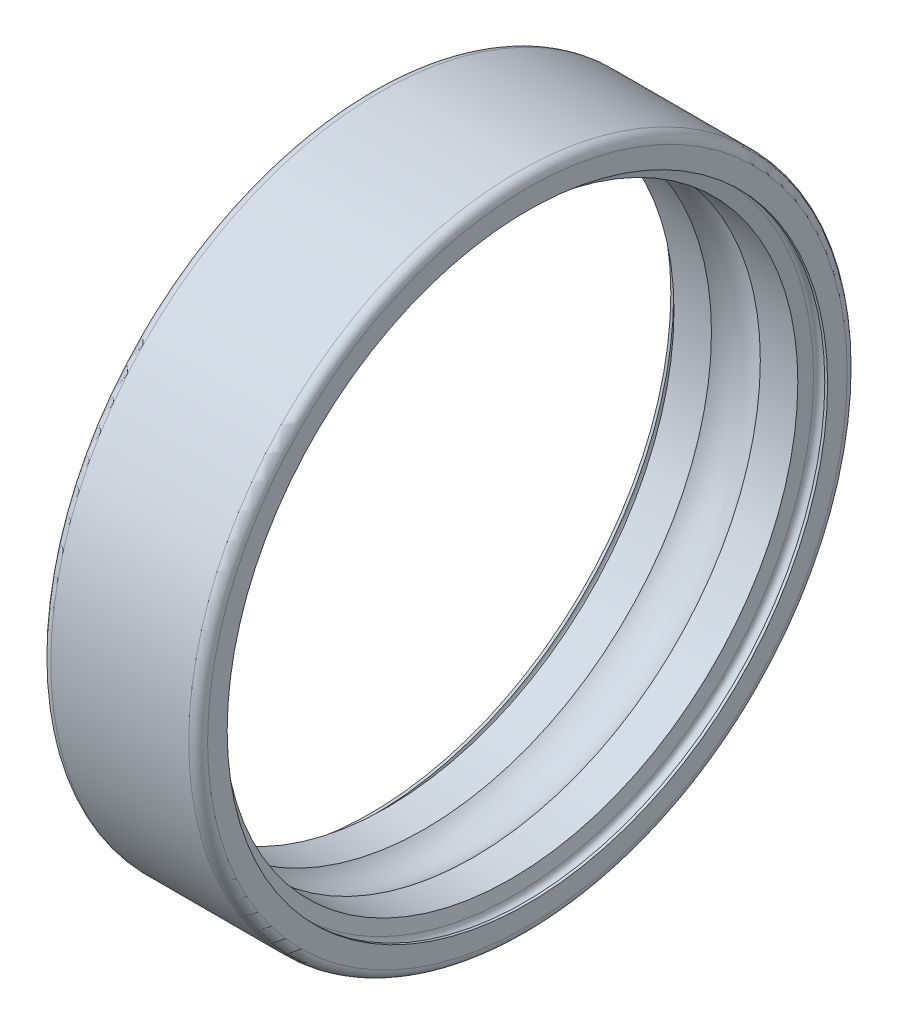
ISO-10303-21;
HEADER;
FILE_DESCRIPTION(('STEP AP214'),'2;1');
FILE_NAME('part.step','',(''),(''),'','','');
FILE_SCHEMA(('AUTOMOTIVE_DESIGN { 1 0 10303 214 1 1 1 1 }'));
ENDSEC;
DATA;
#1=APPLICATION_CONTEXT('core data for automotive mechanical design processes');
#2=APPLICATION_PROTOCOL_DEFINITION('international standard','automotive_design',2000,#1);
#3=PRODUCT_CONTEXT('',#1,'mechanical');
#4=PRODUCT('Part','Part','',(#3));
#5=PRODUCT_RELATED_PRODUCT_CATEGORY('part','',(#4));
#6=PRODUCT_DEFINITION_FORMATION('','',#4);
#7=PRODUCT_DEFINITION_CONTEXT('part definition',#1,'design');
#8=PRODUCT_DEFINITION('design','',#6,#7);
#9=PRODUCT_DEFINITION_SHAPE('','',#8);
#10=(LENGTH_UNIT() NAMED_UNIT(*) SI_UNIT(.MILLI.,.METRE.));
#11=(NAMED_UNIT(*) PLANE_ANGLE_UNIT() SI_UNIT($,.RADIAN.));
#12=(NAMED_UNIT(*) SI_UNIT($,.STERADIAN.) SOLID_ANGLE_UNIT());
#13=UNCERTAINTY_MEASURE_WITH_UNIT(LENGTH_MEASURE(1.E-05),#10,'distance_accuracy_value','');
#14=(GEOMETRIC_REPRESENTATION_CONTEXT(3) GLOBAL_UNCERTAINTY_ASSIGNED_CONTEXT((#13)) GLOBAL_UNIT_ASSIGNED_CONTEXT((#10,
#11,#12)) REPRESENTATION_CONTEXT('',''));
#15=CARTESIAN_POINT('',(0.,0.,0.));
#16=DIRECTION('',(0.,0.,1.));
#17=DIRECTION('',(1.,0.,0.));
#18=AXIS2_PLACEMENT_3D('',#15,#16,#17);
#19=CARTESIAN_POINT('',(2.5,0.,0.));
#20=DIRECTION('',(1.,0.,0.));
#21=DIRECTION('',(0.,0.,-1.));
#22=AXIS2_PLACEMENT_3D('',#19,#20,#21);
#23=TOROIDAL_SURFACE('',#22,8.25000000000001,1.19049999999999);
#24=CARTESIAN_POINT('',(3.27928829710191,0.,0.));
#25=DIRECTION('',(-1.,0.,0.));
#26=DIRECTION('',(0.,0.,1.));
#27=AXIS2_PLACEMENT_3D('',#24,#25,#26);
#28=CIRCLE('',#27,9.15);
#29=CARTESIAN_POINT('',(3.27928829710191,0.,9.15));
#30=VERTEX_POINT('',#29);
#31=EDGE_CURVE('E123',#30,#30,#28,.F.);
#32=ORIENTED_EDGE('',*,*,#31,.T.);
#33=EDGE_LOOP('',(#32));
#34=FACE_BOUND('',#33,.T.);
#35=CARTESIAN_POINT('',(1.72071170289809,0.,0.));
#36=DIRECTION('',(-1.,0.,0.));
#37=DIRECTION('',(0.,0.,1.));
#38=AXIS2_PLACEMENT_3D('',#35,#36,#37);
#39=CIRCLE('',#38,9.15);
#40=CARTESIAN_POINT('',(1.72071170289809,0.,9.15));
#41=VERTEX_POINT('',#40);
#42=EDGE_CURVE('E128',#41,#41,#39,.T.);
#43=ORIENTED_EDGE('',*,*,#42,.T.);
#44=EDGE_LOOP('',(#43));
#45=FACE_BOUND('',#44,.T.);
#46=ADVANCED_FACE('F14',(#34,#45),#23,.F.);
#47=CARTESIAN_POINT('',(50.,0.,0.));
#48=DIRECTION('',(-1.,0.,0.));
#49=DIRECTION('',(0.,0.,1.));
#50=AXIS2_PLACEMENT_3D('',#47,#48,#49);
#51=CYLINDRICAL_SURFACE('',#50,9.15);
#52=CARTESIAN_POINT('',(0.524938966801098,0.,0.));
#53=DIRECTION('',(-1.,0.,0.));
#54=DIRECTION('',(0.,0.,1.));
#55=AXIS2_PLACEMENT_3D('',#52,#53,#54);
#56=CIRCLE('',#55,9.15);
#57=CARTESIAN_POINT('',(0.524938966801098,0.,9.15));
#58=VERTEX_POINT('',#57);
#59=EDGE_CURVE('E118',#58,#58,#56,.T.);
#60=ORIENTED_EDGE('',*,*,#59,.T.);
#61=EDGE_LOOP('',(#60));
#62=FACE_BOUND('',#61,.T.);
#63=ORIENTED_EDGE('',*,*,#42,.F.);
#64=EDGE_LOOP('',(#63));
#65=FACE_BOUND('',#64,.T.);
#66=ADVANCED_FACE('F242',(#62,#65),#51,.F.);
#67=CARTESIAN_POINT('',(50.,0.,0.));
#68=DIRECTION('',(-1.,0.,0.));
#69=DIRECTION('',(0.,0.,1.));
#70=AXIS2_PLACEMENT_3D('',#67,#68,#69);
#71=CYLINDRICAL_SURFACE('',#70,9.15);
#72=ORIENTED_EDGE('',*,*,#31,.F.);
#73=EDGE_LOOP('',(#72));
#74=FACE_BOUND('',#73,.T.);
#75=CARTESIAN_POINT('',(4.4750610331989,0.,0.));
#76=DIRECTION('',(1.,0.,0.));
#77=DIRECTION('',(0.,0.,-1.));
#78=AXIS2_PLACEMENT_3D('',#75,#76,#77);
#79=CIRCLE('',#78,9.15);
#80=CARTESIAN_POINT('',(4.4750610331989,0.,-9.15));
#81=VERTEX_POINT('',#80);
#82=EDGE_CURVE('E113',#81,#81,#79,.T.);
#83=ORIENTED_EDGE('',*,*,#82,.T.);
#84=EDGE_LOOP('',(#83));
#85=FACE_BOUND('',#84,.T.);
#86=ADVANCED_FACE('F232',(#74,#85),#71,.F.);
#87=CARTESIAN_POINT('',(0.449999999999999,0.,0.));
#88=DIRECTION('',(-1.,0.,0.));
#89=DIRECTION('',(0.,0.,1.));
#90=AXIS2_PLACEMENT_3D('',#87,#88,#89);
#91=CONICAL_SURFACE('',#90,9.575,1.39626340159546);
#92=CARTESIAN_POINT('',(0.45,0.,0.));
#93=DIRECTION('',(1.,0.,0.));
#94=DIRECTION('',(0.,0.,-1.));
#95=AXIS2_PLACEMENT_3D('',#92,#93,#94);
#96=CIRCLE('',#95,9.575);
#97=CARTESIAN_POINT('',(0.45,0.,-9.575));
#98=VERTEX_POINT('',#97);
#99=EDGE_CURVE('E107',#98,#98,#96,.F.);
#100=ORIENTED_EDGE('',*,*,#99,.T.);
#101=EDGE_LOOP('',(#100));
#102=FACE_BOUND('',#101,.T.);
#103=ORIENTED_EDGE('',*,*,#59,.F.);
#104=EDGE_LOOP('',(#103));
#105=FACE_BOUND('',#104,.T.);
#106=ADVANCED_FACE('F166',(#102,#105),#91,.F.);
#107=CARTESIAN_POINT('',(4.55,0.,0.));
#108=DIRECTION('',(1.,0.,0.));
#109=DIRECTION('',(0.,0.,-1.));
#110=AXIS2_PLACEMENT_3D('',#107,#108,#109);
#111=CONICAL_SURFACE('',#110,9.575,1.39626340159547);
#112=ORIENTED_EDGE('',*,*,#82,.F.);
#113=EDGE_LOOP('',(#112));
#114=FACE_BOUND('',#113,.T.);
#115=CARTESIAN_POINT('',(4.55,0.,0.));
#116=DIRECTION('',(1.,0.,0.));
#117=DIRECTION('',(0.,0.,-1.));
#118=AXIS2_PLACEMENT_3D('',#115,#116,#117);
#119=CIRCLE('',#118,9.575);
#120=CARTESIAN_POINT('',(4.55,0.,-9.575));
#121=VERTEX_POINT('',#120);
#122=EDGE_CURVE('E103',#121,#121,#119,.T.);
#123=ORIENTED_EDGE('',*,*,#122,.T.);
#124=EDGE_LOOP('',(#123));
#125=FACE_BOUND('',#124,.T.);
#126=ADVANCED_FACE('F160',(#114,#125),#111,.F.);
#127=CARTESIAN_POINT('',(0.27,0.,0.));
#128=DIRECTION('',(1.,0.,0.));
#129=DIRECTION('',(0.,0.,-1.));
#130=AXIS2_PLACEMENT_3D('',#127,#128,#129);
#131=TOROIDAL_SURFACE('',#130,9.575,0.18);
#132=ORIENTED_EDGE('',*,*,#99,.F.);
#133=EDGE_LOOP('',(#132));
#134=FACE_BOUND('',#133,.T.);
#135=CARTESIAN_POINT('',(0.0899999999999998,0.,0.));
#136=DIRECTION('',(-1.,0.,0.));
#137=DIRECTION('',(0.,0.,1.));
#138=AXIS2_PLACEMENT_3D('',#135,#136,#137);
#139=CIRCLE('',#138,9.575);
#140=CARTESIAN_POINT('',(0.0899999999999998,0.,9.575));
#141=VERTEX_POINT('',#140);
#142=EDGE_CURVE('E106',#141,#141,#139,.T.);
#143=ORIENTED_EDGE('',*,*,#142,.T.);
#144=EDGE_LOOP('',(#143));
#145=FACE_BOUND('',#144,.T.);
#146=ADVANCED_FACE('F94',(#134,#145),#131,.F.);
#147=CARTESIAN_POINT('',(4.73,0.,0.));
#148=DIRECTION('',(1.,0.,0.));
#149=DIRECTION('',(0.,0.,-1.));
#150=AXIS2_PLACEMENT_3D('',#147,#148,#149);
#151=TOROIDAL_SURFACE('',#150,9.575,0.18);
#152=CARTESIAN_POINT('',(4.91,0.,0.));
#153=DIRECTION('',(-1.,0.,0.));
#154=DIRECTION('',(0.,0.,1.));
#155=AXIS2_PLACEMENT_3D('',#152,#153,#154);
#156=CIRCLE('',#155,9.575);
#157=CARTESIAN_POINT('',(4.91,0.,9.575));
#158=VERTEX_POINT('',#157);
#159=EDGE_CURVE('E140',#158,#158,#156,.F.);
#160=ORIENTED_EDGE('',*,*,#159,.T.);
#161=EDGE_LOOP('',(#160));
#162=FACE_BOUND('',#161,.T.);
#163=ORIENTED_EDGE('',*,*,#122,.F.);
#164=EDGE_LOOP('',(#163));
#165=FACE_BOUND('',#164,.T.);
#166=ADVANCED_FACE('F89',(#162,#165),#151,.F.);
#167=CARTESIAN_POINT('',(50.,0.,0.));
#168=DIRECTION('',(-1.,0.,0.));
#169=DIRECTION('',(0.,0.,1.));
#170=AXIS2_PLACEMENT_3D('',#167,#168,#169);
#171=CYLINDRICAL_SURFACE('',#170,9.575);
#172=CARTESIAN_POINT('',(0.,0.,0.));
#173=DIRECTION('',(-1.,0.,0.));
#174=DIRECTION('',(0.,0.,1.));
#175=AXIS2_PLACEMENT_3D('',#172,#173,#174);
#176=CIRCLE('',#175,9.575);
#177=CARTESIAN_POINT('',(0.,0.,9.575));
#178=VERTEX_POINT('',#177);
#179=EDGE_CURVE('E18',#178,#178,#176,.F.);
#180=ORIENTED_EDGE('',*,*,#179,.F.);
#181=EDGE_LOOP('',(#180));
#182=FACE_BOUND('',#181,.T.);
#183=ORIENTED_EDGE('',*,*,#142,.F.);
#184=EDGE_LOOP('',(#183));
#185=FACE_BOUND('',#184,.T.);
#186=ADVANCED_FACE('F85',(#182,#185),#171,.F.);
#187=CARTESIAN_POINT('',(50.,0.,0.));
#188=DIRECTION('',(-1.,0.,0.));
#189=DIRECTION('',(0.,0.,1.));
#190=AXIS2_PLACEMENT_3D('',#187,#188,#189);
#191=CYLINDRICAL_SURFACE('',#190,9.575);
#192=ORIENTED_EDGE('',*,*,#159,.F.);
#193=EDGE_LOOP('',(#192));
#194=FACE_BOUND('',#193,.T.);
#195=CARTESIAN_POINT('',(5.,0.,0.));
#196=DIRECTION('',(-1.,0.,0.));
#197=DIRECTION('',(0.,0.,1.));
#198=AXIS2_PLACEMENT_3D('',#195,#196,#197);
#199=CIRCLE('',#198,9.575);
#200=CARTESIAN_POINT('',(5.,0.,9.575));
#201=VERTEX_POINT('',#200);
#202=EDGE_CURVE('E135',#201,#201,#199,.T.);
#203=ORIENTED_EDGE('',*,*,#202,.F.);
#204=EDGE_LOOP('',(#203));
#205=FACE_BOUND('',#204,.T.);
#206=ADVANCED_FACE('F81',(#194,#205),#191,.F.);
#207=CARTESIAN_POINT('',(0.,10.2,0.));
#208=DIRECTION('',(-1.,0.,0.));
#209=DIRECTION('',(0.,0.,1.));
#210=AXIS2_PLACEMENT_3D('',#207,#208,#209);
#211=PLANE('',#210);
#212=CARTESIAN_POINT('',(0.,0.,0.));
#213=DIRECTION('',(1.,0.,0.));
#214=DIRECTION('',(0.,0.,-1.));
#215=AXIS2_PLACEMENT_3D('',#212,#213,#214);
#216=CIRCLE('',#215,10.2);
#217=CARTESIAN_POINT('',(0.,0.,-10.2));
#218=VERTEX_POINT('',#217);
#219=EDGE_CURVE('E65',#218,#218,#216,.T.);
#220=ORIENTED_EDGE('',*,*,#219,.F.);
#221=EDGE_LOOP('',(#220));
#222=FACE_BOUND('',#221,.T.);
#223=ORIENTED_EDGE('',*,*,#179,.T.);
#224=EDGE_LOOP('',(#223));
#225=FACE_BOUND('',#224,.T.);
#226=ADVANCED_FACE('F71',(#222,#225),#211,.T.);
#227=CARTESIAN_POINT('',(5.,9.575,0.));
#228=DIRECTION('',(1.,0.,0.));
#229=DIRECTION('',(0.,0.,-1.));
#230=AXIS2_PLACEMENT_3D('',#227,#228,#229);
#231=PLANE('',#230);
#232=ORIENTED_EDGE('',*,*,#202,.T.);
#233=EDGE_LOOP('',(#232));
#234=FACE_BOUND('',#233,.T.);
#235=CARTESIAN_POINT('',(5.,0.,0.));
#236=DIRECTION('',(-1.,0.,0.));
#237=DIRECTION('',(0.,0.,-1.));
#238=AXIS2_PLACEMENT_3D('',#235,#236,#237);
#239=CIRCLE('',#238,10.2);
#240=CARTESIAN_POINT('',(5.,0.,-10.2));
#241=VERTEX_POINT('',#240);
#242=EDGE_CURVE('E27',#241,#241,#239,.T.);
#243=ORIENTED_EDGE('',*,*,#242,.F.);
#244=EDGE_LOOP('',(#243));
#245=FACE_BOUND('',#244,.T.);
#246=ADVANCED_FACE('F80',(#234,#245),#231,.T.);
#247=CARTESIAN_POINT('',(0.300000000000002,0.,0.));
#248=DIRECTION('',(1.,0.,0.));
#249=DIRECTION('',(0.,0.,-1.));
#250=AXIS2_PLACEMENT_3D('',#247,#248,#249);
#251=TOROIDAL_SURFACE('',#250,10.2,0.300000000000003);
#252=CARTESIAN_POINT('',(0.300000000000002,0.,0.));
#253=DIRECTION('',(-1.,0.,0.));
#254=DIRECTION('',(0.,0.,1.));
#255=AXIS2_PLACEMENT_3D('',#252,#253,#254);
#256=CIRCLE('',#255,10.5);
#257=CARTESIAN_POINT('',(0.300000000000002,0.,10.5));
#258=VERTEX_POINT('',#257);
#259=EDGE_CURVE('E22',#258,#258,#256,.F.);
#260=ORIENTED_EDGE('',*,*,#259,.F.);
#261=EDGE_LOOP('',(#260));
#262=FACE_BOUND('',#261,.T.);
#263=ORIENTED_EDGE('',*,*,#219,.T.);
#264=EDGE_LOOP('',(#263));
#265=FACE_BOUND('',#264,.T.);
#266=ADVANCED_FACE('F45',(#262,#265),#251,.T.);
#267=CARTESIAN_POINT('',(4.7,0.,0.));
#268=DIRECTION('',(1.,0.,0.));
#269=DIRECTION('',(0.,0.,-1.));
#270=AXIS2_PLACEMENT_3D('',#267,#268,#269);
#271=TOROIDAL_SURFACE('',#270,10.2,0.300000000000003);
#272=ORIENTED_EDGE('',*,*,#242,.T.);
#273=EDGE_LOOP('',(#272));
#274=FACE_BOUND('',#273,.T.);
#275=CARTESIAN_POINT('',(4.7,0.,0.));
#276=DIRECTION('',(-1.,0.,0.));
#277=DIRECTION('',(0.,0.,1.));
#278=AXIS2_PLACEMENT_3D('',#275,#276,#277);
#279=CIRCLE('',#278,10.5);
#280=CARTESIAN_POINT('',(4.7,0.,10.5));
#281=VERTEX_POINT('',#280);
#282=EDGE_CURVE('E10',#281,#281,#279,.T.);
#283=ORIENTED_EDGE('',*,*,#282,.F.);
#284=EDGE_LOOP('',(#283));
#285=FACE_BOUND('',#284,.T.);
#286=ADVANCED_FACE('F39',(#274,#285),#271,.T.);
#287=CARTESIAN_POINT('',(50.,0.,0.));
#288=DIRECTION('',(-1.,0.,0.));
#289=DIRECTION('',(0.,0.,1.));
#290=AXIS2_PLACEMENT_3D('',#287,#288,#289);
#291=CYLINDRICAL_SURFACE('',#290,10.5);
#292=ORIENTED_EDGE('',*,*,#282,.T.);
#293=EDGE_LOOP('',(#292));
#294=FACE_BOUND('',#293,.T.);
#295=ORIENTED_EDGE('',*,*,#259,.T.);
#296=EDGE_LOOP('',(#295));
#297=FACE_BOUND('',#296,.T.);
#298=ADVANCED_FACE('F44',(#294,#297),#291,.T.);
#299=CLOSED_SHELL('',(#46,#66,#86,#106,#126,#146,#166,#186,#206,#226,#246,#266,#286,#298));
#300=MANIFOLD_SOLID_BREP('B1',#299);
#301=ADVANCED_BREP_SHAPE_REPRESENTATION('',(#18,#300),#14);
#302=SHAPE_DEFINITION_REPRESENTATION(#9,#301);
ENDSEC;
END-ISO-10303-21;
